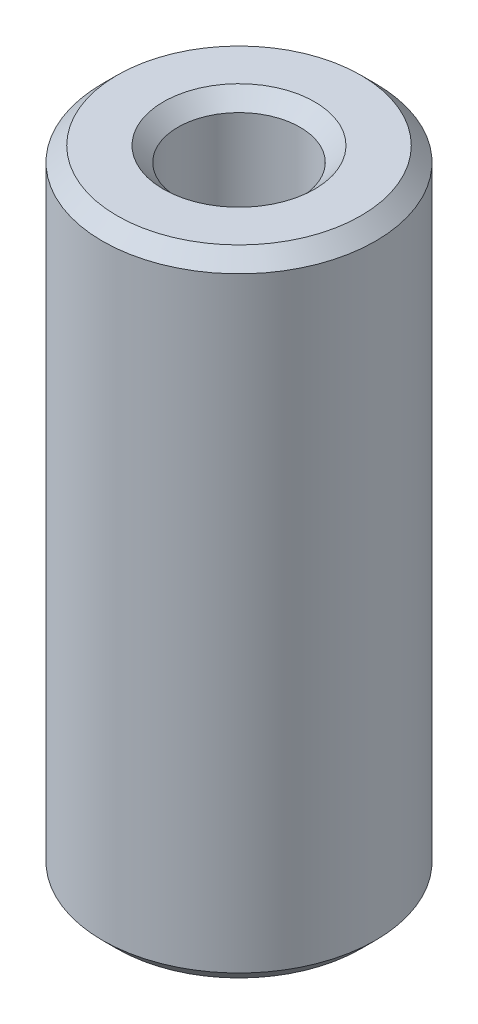
ISO-10303-21;
HEADER;
FILE_DESCRIPTION(('STEP AP214'),'2;1');
FILE_NAME('part.step','',(''),(''),'','','');
FILE_SCHEMA(('AUTOMOTIVE_DESIGN { 1 0 10303 214 1 1 1 1 }'));
ENDSEC;
DATA;
#1=APPLICATION_CONTEXT('core data for automotive mechanical design processes');
#2=APPLICATION_PROTOCOL_DEFINITION('international standard','automotive_design',2000,#1);
#3=PRODUCT_CONTEXT('',#1,'mechanical');
#4=PRODUCT('Part','Part','',(#3));
#5=PRODUCT_RELATED_PRODUCT_CATEGORY('part','',(#4));
#6=PRODUCT_DEFINITION_FORMATION('','',#4);
#7=PRODUCT_DEFINITION_CONTEXT('part definition',#1,'design');
#8=PRODUCT_DEFINITION('design','',#6,#7);
#9=PRODUCT_DEFINITION_SHAPE('','',#8);
#10=(LENGTH_UNIT() NAMED_UNIT(*) SI_UNIT(.MILLI.,.METRE.));
#11=(NAMED_UNIT(*) PLANE_ANGLE_UNIT() SI_UNIT($,.RADIAN.));
#12=(NAMED_UNIT(*) SI_UNIT($,.STERADIAN.) SOLID_ANGLE_UNIT());
#13=UNCERTAINTY_MEASURE_WITH_UNIT(LENGTH_MEASURE(1.E-05),#10,'distance_accuracy_value','');
#14=(GEOMETRIC_REPRESENTATION_CONTEXT(3) GLOBAL_UNCERTAINTY_ASSIGNED_CONTEXT((#13)) GLOBAL_UNIT_ASSIGNED_CONTEXT((#10,
#11,#12)) REPRESENTATION_CONTEXT('',''));
#15=CARTESIAN_POINT('',(0.,0.,0.));
#16=DIRECTION('',(0.,0.,1.));
#17=DIRECTION('',(1.,0.,0.));
#18=AXIS2_PLACEMENT_3D('',#15,#16,#17);
#19=CARTESIAN_POINT('',(0.,58.1393404421618,0.));
#20=DIRECTION('',(0.,-1.,0.));
#21=DIRECTION('',(0.,0.,-1.));
#22=AXIS2_PLACEMENT_3D('',#19,#20,#21);
#23=CYLINDRICAL_SURFACE('',#22,12.5);
#24=CARTESIAN_POINT('',(0.,1.3416785740803,0.));
#25=DIRECTION('',(0.,1.,0.));
#26=DIRECTION('',(0.,0.,1.));
#27=AXIS2_PLACEMENT_3D('',#24,#25,#26);
#28=CIRCLE('',#27,12.5);
#29=CARTESIAN_POINT('',(0.,1.3416785740803,12.5));
#30=VERTEX_POINT('',#29);
#31=EDGE_CURVE('E10',#30,#30,#28,.T.);
#32=ORIENTED_EDGE('',*,*,#31,.T.);
#33=EDGE_LOOP('',(#32));
#34=FACE_BOUND('',#33,.T.);
#35=CARTESIAN_POINT('',(0.,56.7976618680815,0.));
#36=DIRECTION('',(0.,1.,0.));
#37=DIRECTION('',(0.,0.,1.));
#38=AXIS2_PLACEMENT_3D('',#35,#36,#37);
#39=CIRCLE('',#38,12.5);
#40=CARTESIAN_POINT('',(0.,56.7976618680815,12.5));
#41=VERTEX_POINT('',#40);
#42=EDGE_CURVE('E50',#41,#41,#39,.F.);
#43=ORIENTED_EDGE('',*,*,#42,.T.);
#44=EDGE_LOOP('',(#43));
#45=FACE_BOUND('',#44,.T.);
#46=ADVANCED_FACE('F39',(#34,#45),#23,.T.);
#47=CARTESIAN_POINT('',(0.,58.1393404421618,0.));
#48=DIRECTION('',(0.,1.,0.));
#49=DIRECTION('',(0.,0.,1.));
#50=AXIS2_PLACEMENT_3D('',#47,#48,#49);
#51=PLANE('',#50);
#52=CARTESIAN_POINT('',(0.,58.1393404421618,0.));
#53=DIRECTION('',(0.,1.,0.));
#54=DIRECTION('',(0.,0.,1.));
#55=AXIS2_PLACEMENT_3D('',#52,#53,#54);
#56=CIRCLE('',#55,6.93173182988095);
#57=CARTESIAN_POINT('',(0.,58.1393404421618,6.93173182988095));
#58=VERTEX_POINT('',#57);
#59=EDGE_CURVE('E58',#58,#58,#56,.F.);
#60=ORIENTED_EDGE('',*,*,#59,.T.);
#61=EDGE_LOOP('',(#60));
#62=FACE_BOUND('',#61,.T.);
#63=CARTESIAN_POINT('',(0.,58.1393404421618,0.));
#64=DIRECTION('',(0.,1.,0.));
#65=DIRECTION('',(0.,0.,1.));
#66=AXIS2_PLACEMENT_3D('',#63,#64,#65);
#67=CIRCLE('',#66,11.1583214259197);
#68=CARTESIAN_POINT('',(0.,58.1393404421618,11.1583214259197));
#69=VERTEX_POINT('',#68);
#70=EDGE_CURVE('E61',#69,#69,#67,.T.);
#71=ORIENTED_EDGE('',*,*,#70,.T.);
#72=EDGE_LOOP('',(#71));
#73=FACE_BOUND('',#72,.T.);
#74=ADVANCED_FACE('F88',(#62,#73),#51,.T.);
#75=CARTESIAN_POINT('',(0.,0.,0.));
#76=DIRECTION('',(0.,1.,0.));
#77=DIRECTION('',(0.,0.,1.));
#78=AXIS2_PLACEMENT_3D('',#75,#76,#77);
#79=PLANE('',#78);
#80=CARTESIAN_POINT('',(0.,0.,0.));
#81=DIRECTION('',(0.,1.,0.));
#82=DIRECTION('',(0.,0.,1.));
#83=AXIS2_PLACEMENT_3D('',#80,#81,#82);
#84=CIRCLE('',#83,6.93173182988095);
#85=CARTESIAN_POINT('',(0.,0.,6.93173182988095));
#86=VERTEX_POINT('',#85);
#87=EDGE_CURVE('E51',#86,#86,#84,.T.);
#88=ORIENTED_EDGE('',*,*,#87,.T.);
#89=EDGE_LOOP('',(#88));
#90=FACE_BOUND('',#89,.T.);
#91=CARTESIAN_POINT('',(0.,0.,0.));
#92=DIRECTION('',(0.,1.,0.));
#93=DIRECTION('',(0.,0.,1.));
#94=AXIS2_PLACEMENT_3D('',#91,#92,#93);
#95=CIRCLE('',#94,11.1583214259197);
#96=CARTESIAN_POINT('',(0.,0.,11.1583214259197));
#97=VERTEX_POINT('',#96);
#98=EDGE_CURVE('E54',#97,#97,#95,.F.);
#99=ORIENTED_EDGE('',*,*,#98,.T.);
#100=EDGE_LOOP('',(#99));
#101=FACE_BOUND('',#100,.T.);
#102=ADVANCED_FACE('F83',(#90,#101),#79,.F.);
#103=CARTESIAN_POINT('',(0.,58.1393404421618,0.));
#104=DIRECTION('',(0.,-1.,0.));
#105=DIRECTION('',(0.,0.,-1.));
#106=AXIS2_PLACEMENT_3D('',#103,#104,#105);
#107=CYLINDRICAL_SURFACE('',#106,5.59005325580065);
#108=CARTESIAN_POINT('',(0.,56.7976618680815,0.));
#109=DIRECTION('',(0.,1.,0.));
#110=DIRECTION('',(0.,0.,1.));
#111=AXIS2_PLACEMENT_3D('',#108,#109,#110);
#112=CIRCLE('',#111,5.59005325580065);
#113=CARTESIAN_POINT('',(0.,56.7976618680815,5.59005325580065));
#114=VERTEX_POINT('',#113);
#115=EDGE_CURVE('E67',#114,#114,#112,.T.);
#116=ORIENTED_EDGE('',*,*,#115,.T.);
#117=EDGE_LOOP('',(#116));
#118=FACE_BOUND('',#117,.T.);
#119=CARTESIAN_POINT('',(0.,1.34167857408031,0.));
#120=DIRECTION('',(0.,1.,0.));
#121=DIRECTION('',(0.,0.,1.));
#122=AXIS2_PLACEMENT_3D('',#119,#120,#121);
#123=CIRCLE('',#122,5.59005325580065);
#124=CARTESIAN_POINT('',(0.,1.34167857408031,5.59005325580065));
#125=VERTEX_POINT('',#124);
#126=EDGE_CURVE('E69',#125,#125,#123,.F.);
#127=ORIENTED_EDGE('',*,*,#126,.T.);
#128=EDGE_LOOP('',(#127));
#129=FACE_BOUND('',#128,.T.);
#130=ADVANCED_FACE('F71',(#118,#129),#107,.F.);
#131=CARTESIAN_POINT('',(0.,56.7976618680815,0.));
#132=DIRECTION('',(0.,1.,0.));
#133=DIRECTION('',(0.,0.,1.));
#134=AXIS2_PLACEMENT_3D('',#131,#132,#133);
#135=CONICAL_SURFACE('',#134,5.59005325580065,0.785398163397451);
#136=ORIENTED_EDGE('',*,*,#59,.F.);
#137=EDGE_LOOP('',(#136));
#138=FACE_BOUND('',#137,.T.);
#139=ORIENTED_EDGE('',*,*,#115,.F.);
#140=EDGE_LOOP('',(#139));
#141=FACE_BOUND('',#140,.T.);
#142=ADVANCED_FACE('F77',(#138,#141),#135,.F.);
#143=CARTESIAN_POINT('',(0.,0.,0.));
#144=DIRECTION('',(0.,-1.,0.));
#145=DIRECTION('',(0.,0.,-1.));
#146=AXIS2_PLACEMENT_3D('',#143,#144,#145);
#147=CONICAL_SURFACE('',#146,6.93173182988095,0.785398163397444);
#148=ORIENTED_EDGE('',*,*,#126,.F.);
#149=EDGE_LOOP('',(#148));
#150=FACE_BOUND('',#149,.T.);
#151=ORIENTED_EDGE('',*,*,#87,.F.);
#152=EDGE_LOOP('',(#151));
#153=FACE_BOUND('',#152,.T.);
#154=ADVANCED_FACE('F73',(#150,#153),#147,.F.);
#155=CARTESIAN_POINT('',(0.,1.3416785740803,0.));
#156=DIRECTION('',(0.,1.,0.));
#157=DIRECTION('',(0.,0.,1.));
#158=AXIS2_PLACEMENT_3D('',#155,#156,#157);
#159=CONICAL_SURFACE('',#158,12.5,0.785398163397451);
#160=ORIENTED_EDGE('',*,*,#98,.F.);
#161=EDGE_LOOP('',(#160));
#162=FACE_BOUND('',#161,.T.);
#163=ORIENTED_EDGE('',*,*,#31,.F.);
#164=EDGE_LOOP('',(#163));
#165=FACE_BOUND('',#164,.T.);
#166=ADVANCED_FACE('F76',(#162,#165),#159,.T.);
#167=CARTESIAN_POINT('',(0.,58.1393404421618,0.));
#168=DIRECTION('',(0.,-1.,0.));
#169=DIRECTION('',(0.,0.,-1.));
#170=AXIS2_PLACEMENT_3D('',#167,#168,#169);
#171=CONICAL_SURFACE('',#170,11.1583214259197,0.785398163397439);
#172=ORIENTED_EDGE('',*,*,#42,.F.);
#173=EDGE_LOOP('',(#172));
#174=FACE_BOUND('',#173,.T.);
#175=ORIENTED_EDGE('',*,*,#70,.F.);
#176=EDGE_LOOP('',(#175));
#177=FACE_BOUND('',#176,.T.);
#178=ADVANCED_FACE('F45',(#174,#177),#171,.T.);
#179=CLOSED_SHELL('',(#46,#74,#102,#130,#142,#154,#166,#178));
#180=MANIFOLD_SOLID_BREP('B2',#179);
#181=ADVANCED_BREP_SHAPE_REPRESENTATION('',(#18,#180),#14);
#182=SHAPE_DEFINITION_REPRESENTATION(#9,#181);
ENDSEC;
END-ISO-10303-21;
